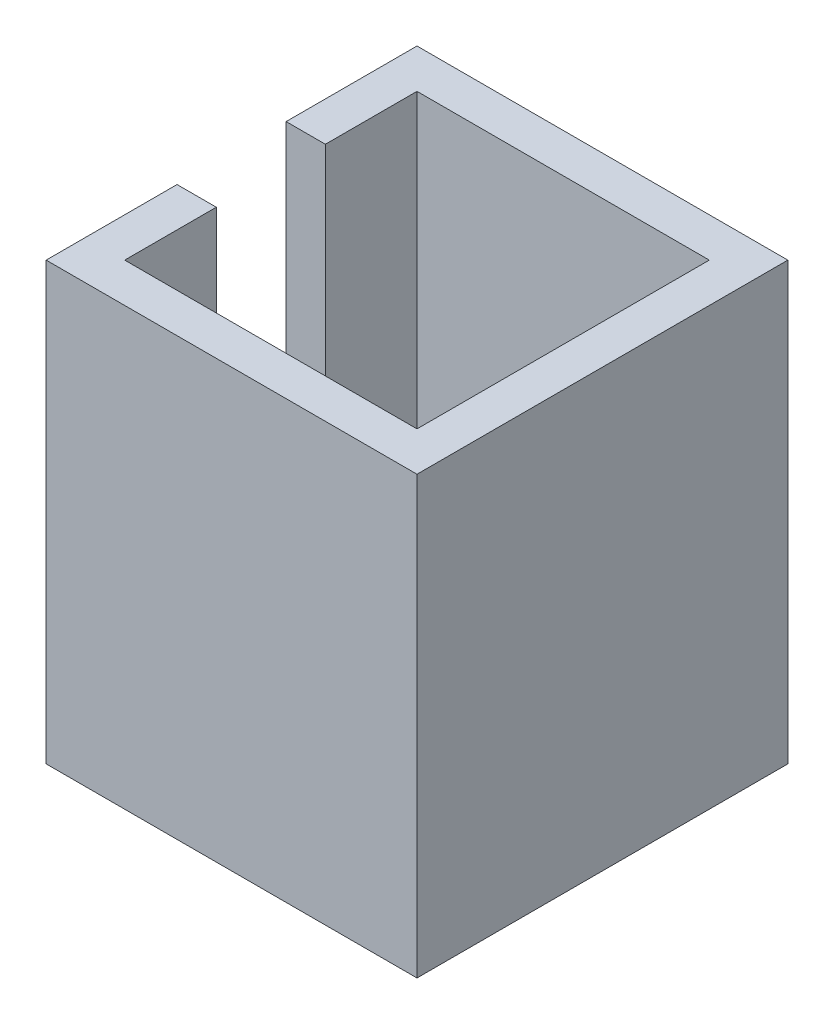
ISO-10303-21;
HEADER;
FILE_DESCRIPTION(('STEP AP214'),'2;1');
FILE_NAME('part.step','',(''),(''),'','','');
FILE_SCHEMA(('AUTOMOTIVE_DESIGN { 1 0 10303 214 1 1 1 1 }'));
ENDSEC;
DATA;
#1=APPLICATION_CONTEXT('core data for automotive mechanical design processes');
#2=APPLICATION_PROTOCOL_DEFINITION('international standard','automotive_design',2000,#1);
#3=PRODUCT_CONTEXT('',#1,'mechanical');
#4=PRODUCT('Part','Part','',(#3));
#5=PRODUCT_RELATED_PRODUCT_CATEGORY('part','',(#4));
#6=PRODUCT_DEFINITION_FORMATION('','',#4);
#7=PRODUCT_DEFINITION_CONTEXT('part definition',#1,'design');
#8=PRODUCT_DEFINITION('design','',#6,#7);
#9=PRODUCT_DEFINITION_SHAPE('','',#8);
#10=(LENGTH_UNIT() NAMED_UNIT(*) SI_UNIT(.MILLI.,.METRE.));
#11=(NAMED_UNIT(*) PLANE_ANGLE_UNIT() SI_UNIT($,.RADIAN.));
#12=(NAMED_UNIT(*) SI_UNIT($,.STERADIAN.) SOLID_ANGLE_UNIT());
#13=UNCERTAINTY_MEASURE_WITH_UNIT(LENGTH_MEASURE(1.E-05),#10,'distance_accuracy_value','');
#14=(GEOMETRIC_REPRESENTATION_CONTEXT(3) GLOBAL_UNCERTAINTY_ASSIGNED_CONTEXT((#13)) GLOBAL_UNIT_ASSIGNED_CONTEXT((#10,
#11,#12)) REPRESENTATION_CONTEXT('',''));
#15=CARTESIAN_POINT('',(0.,0.,0.));
#16=DIRECTION('',(0.,0.,1.));
#17=DIRECTION('',(1.,0.,0.));
#18=AXIS2_PLACEMENT_3D('',#15,#16,#17);
#19=CARTESIAN_POINT('',(0.,20.,0.));
#20=DIRECTION('',(0.,-1.,0.));
#21=DIRECTION('',(0.,0.,-1.));
#22=AXIS2_PLACEMENT_3D('',#19,#20,#21);
#23=PLANE('',#22);
#24=DIRECTION('',(0.,0.,1.));
#25=VECTOR('',#24,1.);
#26=CARTESIAN_POINT('',(0.,20.,0.));
#27=LINE('',#26,#25);
#28=CARTESIAN_POINT('',(0.,20.,-17.));
#29=VERTEX_POINT('',#28);
#30=CARTESIAN_POINT('',(0.,20.,-11.));
#31=VERTEX_POINT('',#30);
#32=EDGE_CURVE('E186',#29,#31,#27,.T.);
#33=ORIENTED_EDGE('',*,*,#32,.T.);
#34=DIRECTION('',(-1.,0.,0.));
#35=VECTOR('',#34,1.);
#36=CARTESIAN_POINT('',(4.,20.,-11.));
#37=LINE('',#36,#35);
#38=CARTESIAN_POINT('',(1.8,20.,-11.));
#39=VERTEX_POINT('',#38);
#40=EDGE_CURVE('E136',#39,#31,#37,.T.);
#41=ORIENTED_EDGE('',*,*,#40,.F.);
#42=DIRECTION('',(0.,0.,1.));
#43=VECTOR('',#42,1.);
#44=CARTESIAN_POINT('',(1.8,20.,0.));
#45=LINE('',#44,#43);
#46=CARTESIAN_POINT('',(1.8,20.,-15.2));
#47=VERTEX_POINT('',#46);
#48=EDGE_CURVE('E178',#47,#39,#45,.T.);
#49=ORIENTED_EDGE('',*,*,#48,.F.);
#50=DIRECTION('',(-1.,0.,0.));
#51=VECTOR('',#50,1.);
#52=CARTESIAN_POINT('',(0.,20.,-15.2));
#53=LINE('',#52,#51);
#54=CARTESIAN_POINT('',(15.2,20.,-15.2));
#55=VERTEX_POINT('',#54);
#56=EDGE_CURVE('E168',#55,#47,#53,.T.);
#57=ORIENTED_EDGE('',*,*,#56,.F.);
#58=DIRECTION('',(0.,0.,-1.));
#59=VECTOR('',#58,1.);
#60=CARTESIAN_POINT('',(15.2,20.,0.));
#61=LINE('',#60,#59);
#62=CARTESIAN_POINT('',(15.2,20.,-1.8));
#63=VERTEX_POINT('',#62);
#64=EDGE_CURVE('E183',#63,#55,#61,.T.);
#65=ORIENTED_EDGE('',*,*,#64,.F.);
#66=DIRECTION('',(1.,0.,0.));
#67=VECTOR('',#66,1.);
#68=CARTESIAN_POINT('',(0.,20.,-1.8));
#69=LINE('',#68,#67);
#70=CARTESIAN_POINT('',(1.8,20.,-1.8));
#71=VERTEX_POINT('',#70);
#72=EDGE_CURVE('E181',#71,#63,#69,.T.);
#73=ORIENTED_EDGE('',*,*,#72,.F.);
#74=CARTESIAN_POINT('',(1.8,20.,-6.));
#75=VERTEX_POINT('',#74);
#76=EDGE_CURVE('E177',#75,#71,#45,.T.);
#77=ORIENTED_EDGE('',*,*,#76,.F.);
#78=DIRECTION('',(-1.,0.,0.));
#79=VECTOR('',#78,1.);
#80=CARTESIAN_POINT('',(4.,20.,-6.));
#81=LINE('',#80,#79);
#82=CARTESIAN_POINT('',(0.,20.,-6.));
#83=VERTEX_POINT('',#82);
#84=EDGE_CURVE('E147',#75,#83,#81,.T.);
#85=ORIENTED_EDGE('',*,*,#84,.T.);
#86=CARTESIAN_POINT('',(0.,20.,0.));
#87=VERTEX_POINT('',#86);
#88=EDGE_CURVE('E189',#83,#87,#27,.T.);
#89=ORIENTED_EDGE('',*,*,#88,.T.);
#90=DIRECTION('',(1.,0.,0.));
#91=VECTOR('',#90,1.);
#92=CARTESIAN_POINT('',(0.,20.,0.));
#93=LINE('',#92,#91);
#94=CARTESIAN_POINT('',(17.,20.,0.));
#95=VERTEX_POINT('',#94);
#96=EDGE_CURVE('E188',#87,#95,#93,.T.);
#97=ORIENTED_EDGE('',*,*,#96,.T.);
#98=DIRECTION('',(0.,0.,-1.));
#99=VECTOR('',#98,1.);
#100=CARTESIAN_POINT('',(17.,20.,0.));
#101=LINE('',#100,#99);
#102=CARTESIAN_POINT('',(17.,20.,-17.));
#103=VERTEX_POINT('',#102);
#104=EDGE_CURVE('E191',#95,#103,#101,.T.);
#105=ORIENTED_EDGE('',*,*,#104,.T.);
#106=DIRECTION('',(-1.,0.,0.));
#107=VECTOR('',#106,1.);
#108=CARTESIAN_POINT('',(0.,20.,-17.));
#109=LINE('',#108,#107);
#110=EDGE_CURVE('E193',#103,#29,#109,.T.);
#111=ORIENTED_EDGE('',*,*,#110,.T.);
#112=EDGE_LOOP('',(#33,#41,#49,#57,#65,#73,#77,#85,#89,#97,#105,#111));
#113=FACE_BOUND('',#112,.T.);
#114=ADVANCED_FACE('F33',(#113),#23,.F.);
#115=CARTESIAN_POINT('',(0.,20.,0.));
#116=DIRECTION('',(1.,0.,0.));
#117=DIRECTION('',(0.,0.,-1.));
#118=AXIS2_PLACEMENT_3D('',#115,#116,#117);
#119=PLANE('',#118);
#120=DIRECTION('',(0.,0.,1.));
#121=VECTOR('',#120,1.);
#122=CARTESIAN_POINT('',(0.,4.97774716596375,-6.));
#123=LINE('',#122,#121);
#124=CARTESIAN_POINT('',(0.,4.97774716596375,-11.));
#125=VERTEX_POINT('',#124);
#126=CARTESIAN_POINT('',(0.,4.97774716596375,-6.));
#127=VERTEX_POINT('',#126);
#128=EDGE_CURVE('E124',#125,#127,#123,.T.);
#129=ORIENTED_EDGE('',*,*,#128,.F.);
#130=DIRECTION('',(0.,-1.,0.));
#131=VECTOR('',#130,1.);
#132=CARTESIAN_POINT('',(0.,4.97774716596375,-11.));
#133=LINE('',#132,#131);
#134=EDGE_CURVE('E133',#31,#125,#133,.T.);
#135=ORIENTED_EDGE('',*,*,#134,.F.);
#136=ORIENTED_EDGE('',*,*,#32,.F.);
#137=DIRECTION('',(0.,-1.,0.));
#138=VECTOR('',#137,1.);
#139=CARTESIAN_POINT('',(0.,20.,-17.));
#140=LINE('',#139,#138);
#141=CARTESIAN_POINT('',(0.,0.,-17.));
#142=VERTEX_POINT('',#141);
#143=EDGE_CURVE('E195',#29,#142,#140,.T.);
#144=ORIENTED_EDGE('',*,*,#143,.T.);
#145=DIRECTION('',(0.,0.,1.));
#146=VECTOR('',#145,1.);
#147=CARTESIAN_POINT('',(0.,0.,0.));
#148=LINE('',#147,#146);
#149=CARTESIAN_POINT('',(0.,0.,0.));
#150=VERTEX_POINT('',#149);
#151=EDGE_CURVE('E163',#142,#150,#148,.T.);
#152=ORIENTED_EDGE('',*,*,#151,.T.);
#153=DIRECTION('',(0.,-1.,0.));
#154=VECTOR('',#153,1.);
#155=CARTESIAN_POINT('',(0.,20.,0.));
#156=LINE('',#155,#154);
#157=EDGE_CURVE('E212',#87,#150,#156,.T.);
#158=ORIENTED_EDGE('',*,*,#157,.F.);
#159=ORIENTED_EDGE('',*,*,#88,.F.);
#160=DIRECTION('',(0.,1.,0.));
#161=VECTOR('',#160,1.);
#162=CARTESIAN_POINT('',(0.,4.97774716596375,-6.));
#163=LINE('',#162,#161);
#164=EDGE_CURVE('E130',#127,#83,#163,.T.);
#165=ORIENTED_EDGE('',*,*,#164,.F.);
#166=EDGE_LOOP('',(#129,#135,#136,#144,#152,#158,#159,#165));
#167=FACE_BOUND('',#166,.T.);
#168=ADVANCED_FACE('F35',(#167),#119,.F.);
#169=CARTESIAN_POINT('',(0.,20.,0.));
#170=DIRECTION('',(0.,0.,-1.));
#171=DIRECTION('',(-1.,0.,0.));
#172=AXIS2_PLACEMENT_3D('',#169,#170,#171);
#173=PLANE('',#172);
#174=DIRECTION('',(1.,0.,0.));
#175=VECTOR('',#174,1.);
#176=CARTESIAN_POINT('',(0.,0.,0.));
#177=LINE('',#176,#175);
#178=CARTESIAN_POINT('',(17.,0.,0.));
#179=VERTEX_POINT('',#178);
#180=EDGE_CURVE('E198',#150,#179,#177,.T.);
#181=ORIENTED_EDGE('',*,*,#180,.T.);
#182=DIRECTION('',(0.,-1.,0.));
#183=VECTOR('',#182,1.);
#184=CARTESIAN_POINT('',(17.,20.,0.));
#185=LINE('',#184,#183);
#186=EDGE_CURVE('E209',#95,#179,#185,.T.);
#187=ORIENTED_EDGE('',*,*,#186,.F.);
#188=ORIENTED_EDGE('',*,*,#96,.F.);
#189=ORIENTED_EDGE('',*,*,#157,.T.);
#190=EDGE_LOOP('',(#181,#187,#188,#189));
#191=FACE_BOUND('',#190,.T.);
#192=ADVANCED_FACE('F237',(#191),#173,.F.);
#193=CARTESIAN_POINT('',(17.,20.,0.));
#194=DIRECTION('',(-1.,0.,0.));
#195=DIRECTION('',(0.,0.,1.));
#196=AXIS2_PLACEMENT_3D('',#193,#194,#195);
#197=PLANE('',#196);
#198=DIRECTION('',(0.,0.,-1.));
#199=VECTOR('',#198,1.);
#200=CARTESIAN_POINT('',(17.,0.,0.));
#201=LINE('',#200,#199);
#202=CARTESIAN_POINT('',(17.,0.,-17.));
#203=VERTEX_POINT('',#202);
#204=EDGE_CURVE('E200',#179,#203,#201,.T.);
#205=ORIENTED_EDGE('',*,*,#204,.T.);
#206=DIRECTION('',(0.,-1.,0.));
#207=VECTOR('',#206,1.);
#208=CARTESIAN_POINT('',(17.,20.,-17.));
#209=LINE('',#208,#207);
#210=EDGE_CURVE('E206',#103,#203,#209,.T.);
#211=ORIENTED_EDGE('',*,*,#210,.F.);
#212=ORIENTED_EDGE('',*,*,#104,.F.);
#213=ORIENTED_EDGE('',*,*,#186,.T.);
#214=EDGE_LOOP('',(#205,#211,#212,#213));
#215=FACE_BOUND('',#214,.T.);
#216=ADVANCED_FACE('F272',(#215),#197,.F.);
#217=CARTESIAN_POINT('',(0.,20.,-17.));
#218=DIRECTION('',(0.,0.,1.));
#219=DIRECTION('',(1.,0.,0.));
#220=AXIS2_PLACEMENT_3D('',#217,#218,#219);
#221=PLANE('',#220);
#222=DIRECTION('',(-1.,0.,0.));
#223=VECTOR('',#222,1.);
#224=CARTESIAN_POINT('',(0.,0.,-17.));
#225=LINE('',#224,#223);
#226=EDGE_CURVE('E202',#203,#142,#225,.T.);
#227=ORIENTED_EDGE('',*,*,#226,.T.);
#228=ORIENTED_EDGE('',*,*,#143,.F.);
#229=ORIENTED_EDGE('',*,*,#110,.F.);
#230=ORIENTED_EDGE('',*,*,#210,.T.);
#231=EDGE_LOOP('',(#227,#228,#229,#230));
#232=FACE_BOUND('',#231,.T.);
#233=ADVANCED_FACE('F268',(#232),#221,.F.);
#234=CARTESIAN_POINT('',(0.,0.,0.));
#235=DIRECTION('',(0.,-1.,0.));
#236=DIRECTION('',(0.,0.,-1.));
#237=AXIS2_PLACEMENT_3D('',#234,#235,#236);
#238=PLANE('',#237);
#239=CARTESIAN_POINT('',(8.5,0.,-8.5));
#240=DIRECTION('',(0.,-1.,0.));
#241=DIRECTION('',(0.,0.,-1.));
#242=AXIS2_PLACEMENT_3D('',#239,#240,#241);
#243=CIRCLE('',#242,3.25);
#244=CARTESIAN_POINT('',(8.5,0.,-11.75));
#245=VERTEX_POINT('',#244);
#246=EDGE_CURVE('E146',#245,#245,#243,.T.);
#247=ORIENTED_EDGE('',*,*,#246,.F.);
#248=EDGE_LOOP('',(#247));
#249=FACE_BOUND('',#248,.T.);
#250=ORIENTED_EDGE('',*,*,#151,.F.);
#251=ORIENTED_EDGE('',*,*,#226,.F.);
#252=ORIENTED_EDGE('',*,*,#204,.F.);
#253=ORIENTED_EDGE('',*,*,#180,.F.);
#254=EDGE_LOOP('',(#250,#251,#252,#253));
#255=FACE_BOUND('',#254,.T.);
#256=ADVANCED_FACE('F232',(#249,#255),#238,.T.);
#257=CARTESIAN_POINT('',(1.8,20.,0.));
#258=DIRECTION('',(1.,0.,0.));
#259=DIRECTION('',(0.,0.,-1.));
#260=AXIS2_PLACEMENT_3D('',#257,#258,#259);
#261=PLANE('',#260);
#262=DIRECTION('',(0.,1.,0.));
#263=VECTOR('',#262,1.);
#264=CARTESIAN_POINT('',(1.8,20.,-11.));
#265=LINE('',#264,#263);
#266=CARTESIAN_POINT('',(1.8,4.97774716596375,-11.));
#267=VERTEX_POINT('',#266);
#268=EDGE_CURVE('E11',#267,#39,#265,.T.);
#269=ORIENTED_EDGE('',*,*,#268,.F.);
#270=DIRECTION('',(0.,0.,-1.));
#271=VECTOR('',#270,1.);
#272=CARTESIAN_POINT('',(1.8,4.97774716596376,0.));
#273=LINE('',#272,#271);
#274=CARTESIAN_POINT('',(1.8,4.97774716596376,-6.));
#275=VERTEX_POINT('',#274);
#276=EDGE_CURVE('E127',#275,#267,#273,.T.);
#277=ORIENTED_EDGE('',*,*,#276,.F.);
#278=DIRECTION('',(0.,-1.,0.));
#279=VECTOR('',#278,1.);
#280=CARTESIAN_POINT('',(1.8,20.,-6.));
#281=LINE('',#280,#279);
#282=EDGE_CURVE('E41',#75,#275,#281,.T.);
#283=ORIENTED_EDGE('',*,*,#282,.F.);
#284=ORIENTED_EDGE('',*,*,#76,.T.);
#285=DIRECTION('',(0.,-1.,0.));
#286=VECTOR('',#285,1.);
#287=CARTESIAN_POINT('',(1.8,20.,-1.8));
#288=LINE('',#287,#286);
#289=CARTESIAN_POINT('',(1.8,1.8,-1.8));
#290=VERTEX_POINT('',#289);
#291=EDGE_CURVE('E160',#71,#290,#288,.T.);
#292=ORIENTED_EDGE('',*,*,#291,.T.);
#293=DIRECTION('',(0.,0.,1.));
#294=VECTOR('',#293,1.);
#295=CARTESIAN_POINT('',(1.8,1.8,0.));
#296=LINE('',#295,#294);
#297=CARTESIAN_POINT('',(1.8,1.8,-15.2));
#298=VERTEX_POINT('',#297);
#299=EDGE_CURVE('E156',#298,#290,#296,.T.);
#300=ORIENTED_EDGE('',*,*,#299,.F.);
#301=DIRECTION('',(0.,-1.,0.));
#302=VECTOR('',#301,1.);
#303=CARTESIAN_POINT('',(1.8,20.,-15.2));
#304=LINE('',#303,#302);
#305=EDGE_CURVE('E165',#47,#298,#304,.T.);
#306=ORIENTED_EDGE('',*,*,#305,.F.);
#307=ORIENTED_EDGE('',*,*,#48,.T.);
#308=EDGE_LOOP('',(#269,#277,#283,#284,#292,#300,#306,#307));
#309=FACE_BOUND('',#308,.T.);
#310=ADVANCED_FACE('F220',(#309),#261,.T.);
#311=CARTESIAN_POINT('',(0.,20.,-1.8));
#312=DIRECTION('',(0.,0.,-1.));
#313=DIRECTION('',(-1.,0.,0.));
#314=AXIS2_PLACEMENT_3D('',#311,#312,#313);
#315=PLANE('',#314);
#316=DIRECTION('',(1.,0.,0.));
#317=VECTOR('',#316,1.);
#318=CARTESIAN_POINT('',(0.,1.8,-1.8));
#319=LINE('',#318,#317);
#320=CARTESIAN_POINT('',(15.2,1.8,-1.8));
#321=VERTEX_POINT('',#320);
#322=EDGE_CURVE('E159',#290,#321,#319,.T.);
#323=ORIENTED_EDGE('',*,*,#322,.F.);
#324=ORIENTED_EDGE('',*,*,#291,.F.);
#325=ORIENTED_EDGE('',*,*,#72,.T.);
#326=DIRECTION('',(0.,-1.,0.));
#327=VECTOR('',#326,1.);
#328=CARTESIAN_POINT('',(15.2,20.,-1.8));
#329=LINE('',#328,#327);
#330=EDGE_CURVE('E164',#63,#321,#329,.T.);
#331=ORIENTED_EDGE('',*,*,#330,.T.);
#332=EDGE_LOOP('',(#323,#324,#325,#331));
#333=FACE_BOUND('',#332,.T.);
#334=ADVANCED_FACE('F243',(#333),#315,.T.);
#335=CARTESIAN_POINT('',(15.2,20.,0.));
#336=DIRECTION('',(-1.,0.,0.));
#337=DIRECTION('',(0.,0.,1.));
#338=AXIS2_PLACEMENT_3D('',#335,#336,#337);
#339=PLANE('',#338);
#340=DIRECTION('',(0.,0.,-1.));
#341=VECTOR('',#340,1.);
#342=CARTESIAN_POINT('',(15.2,1.8,0.));
#343=LINE('',#342,#341);
#344=CARTESIAN_POINT('',(15.2,1.8,-15.2));
#345=VERTEX_POINT('',#344);
#346=EDGE_CURVE('E170',#321,#345,#343,.T.);
#347=ORIENTED_EDGE('',*,*,#346,.F.);
#348=ORIENTED_EDGE('',*,*,#330,.F.);
#349=ORIENTED_EDGE('',*,*,#64,.T.);
#350=DIRECTION('',(0.,-1.,0.));
#351=VECTOR('',#350,1.);
#352=CARTESIAN_POINT('',(15.2,20.,-15.2));
#353=LINE('',#352,#351);
#354=EDGE_CURVE('E56',#55,#345,#353,.T.);
#355=ORIENTED_EDGE('',*,*,#354,.T.);
#356=EDGE_LOOP('',(#347,#348,#349,#355));
#357=FACE_BOUND('',#356,.T.);
#358=ADVANCED_FACE('F250',(#357),#339,.T.);
#359=CARTESIAN_POINT('',(0.,20.,-15.2));
#360=DIRECTION('',(0.,0.,1.));
#361=DIRECTION('',(1.,0.,0.));
#362=AXIS2_PLACEMENT_3D('',#359,#360,#361);
#363=PLANE('',#362);
#364=DIRECTION('',(-1.,0.,0.));
#365=VECTOR('',#364,1.);
#366=CARTESIAN_POINT('',(0.,1.8,-15.2));
#367=LINE('',#366,#365);
#368=EDGE_CURVE('E174',#345,#298,#367,.T.);
#369=ORIENTED_EDGE('',*,*,#368,.F.);
#370=ORIENTED_EDGE('',*,*,#354,.F.);
#371=ORIENTED_EDGE('',*,*,#56,.T.);
#372=ORIENTED_EDGE('',*,*,#305,.T.);
#373=EDGE_LOOP('',(#369,#370,#371,#372));
#374=FACE_BOUND('',#373,.T.);
#375=ADVANCED_FACE('F248',(#374),#363,.T.);
#376=CARTESIAN_POINT('',(0.,1.8,0.));
#377=DIRECTION('',(0.,-1.,0.));
#378=DIRECTION('',(0.,0.,-1.));
#379=AXIS2_PLACEMENT_3D('',#376,#377,#378);
#380=PLANE('',#379);
#381=CARTESIAN_POINT('',(8.5,1.8,-8.5));
#382=DIRECTION('',(0.,-1.,0.));
#383=DIRECTION('',(0.,0.,-1.));
#384=AXIS2_PLACEMENT_3D('',#381,#382,#383);
#385=CIRCLE('',#384,3.25);
#386=CARTESIAN_POINT('',(8.5,1.8,-11.75));
#387=VERTEX_POINT('',#386);
#388=EDGE_CURVE('E153',#387,#387,#385,.T.);
#389=ORIENTED_EDGE('',*,*,#388,.T.);
#390=EDGE_LOOP('',(#389));
#391=FACE_BOUND('',#390,.T.);
#392=ORIENTED_EDGE('',*,*,#299,.T.);
#393=ORIENTED_EDGE('',*,*,#322,.T.);
#394=ORIENTED_EDGE('',*,*,#346,.T.);
#395=ORIENTED_EDGE('',*,*,#368,.T.);
#396=EDGE_LOOP('',(#392,#393,#394,#395));
#397=FACE_BOUND('',#396,.T.);
#398=ADVANCED_FACE('F247',(#391,#397),#380,.F.);
#399=CARTESIAN_POINT('',(8.5,0.,-8.5));
#400=DIRECTION('',(0.,-1.,0.));
#401=DIRECTION('',(0.,0.,-1.));
#402=AXIS2_PLACEMENT_3D('',#399,#400,#401);
#403=CYLINDRICAL_SURFACE('',#402,3.25);
#404=ORIENTED_EDGE('',*,*,#246,.T.);
#405=EDGE_LOOP('',(#404));
#406=FACE_BOUND('',#405,.T.);
#407=ORIENTED_EDGE('',*,*,#388,.F.);
#408=EDGE_LOOP('',(#407));
#409=FACE_BOUND('',#408,.T.);
#410=ADVANCED_FACE('F322',(#406,#409),#403,.F.);
#411=CARTESIAN_POINT('',(4.,4.97774716596375,-11.));
#412=DIRECTION('',(0.,0.,-1.));
#413=DIRECTION('',(-1.,0.,0.));
#414=AXIS2_PLACEMENT_3D('',#411,#412,#413);
#415=PLANE('',#414);
#416=ORIENTED_EDGE('',*,*,#268,.T.);
#417=ORIENTED_EDGE('',*,*,#40,.T.);
#418=ORIENTED_EDGE('',*,*,#134,.T.);
#419=DIRECTION('',(-1.,0.,0.));
#420=VECTOR('',#419,1.);
#421=CARTESIAN_POINT('',(4.,4.97774716596375,-11.));
#422=LINE('',#421,#420);
#423=EDGE_CURVE('E120',#267,#125,#422,.T.);
#424=ORIENTED_EDGE('',*,*,#423,.F.);
#425=EDGE_LOOP('',(#416,#417,#418,#424));
#426=FACE_BOUND('',#425,.T.);
#427=ADVANCED_FACE('F134',(#426),#415,.F.);
#428=CARTESIAN_POINT('',(4.,4.97774716596375,-6.));
#429=DIRECTION('',(0.,0.,1.));
#430=DIRECTION('',(1.,0.,0.));
#431=AXIS2_PLACEMENT_3D('',#428,#429,#430);
#432=PLANE('',#431);
#433=ORIENTED_EDGE('',*,*,#282,.T.);
#434=DIRECTION('',(-1.,0.,0.));
#435=VECTOR('',#434,1.);
#436=CARTESIAN_POINT('',(4.,4.97774716596375,-6.));
#437=LINE('',#436,#435);
#438=EDGE_CURVE('E48',#275,#127,#437,.T.);
#439=ORIENTED_EDGE('',*,*,#438,.T.);
#440=ORIENTED_EDGE('',*,*,#164,.T.);
#441=ORIENTED_EDGE('',*,*,#84,.F.);
#442=EDGE_LOOP('',(#433,#439,#440,#441));
#443=FACE_BOUND('',#442,.T.);
#444=ADVANCED_FACE('F217',(#443),#432,.F.);
#445=CARTESIAN_POINT('',(4.,4.97774716596375,-6.));
#446=DIRECTION('',(0.,-1.,0.));
#447=DIRECTION('',(0.,0.,-1.));
#448=AXIS2_PLACEMENT_3D('',#445,#446,#447);
#449=PLANE('',#448);
#450=ORIENTED_EDGE('',*,*,#276,.T.);
#451=ORIENTED_EDGE('',*,*,#423,.T.);
#452=ORIENTED_EDGE('',*,*,#128,.T.);
#453=ORIENTED_EDGE('',*,*,#438,.F.);
#454=EDGE_LOOP('',(#450,#451,#452,#453));
#455=FACE_BOUND('',#454,.T.);
#456=ADVANCED_FACE('F122',(#455),#449,.F.);
#457=CLOSED_SHELL('',(#114,#168,#192,#216,#233,#256,#310,#334,#358,#375,#398,#410,#427,#444,#456));
#458=MANIFOLD_SOLID_BREP('B2',#457);
#459=ADVANCED_BREP_SHAPE_REPRESENTATION('',(#18,#458),#14);
#460=SHAPE_DEFINITION_REPRESENTATION(#9,#459);
ENDSEC;
END-ISO-10303-21;
